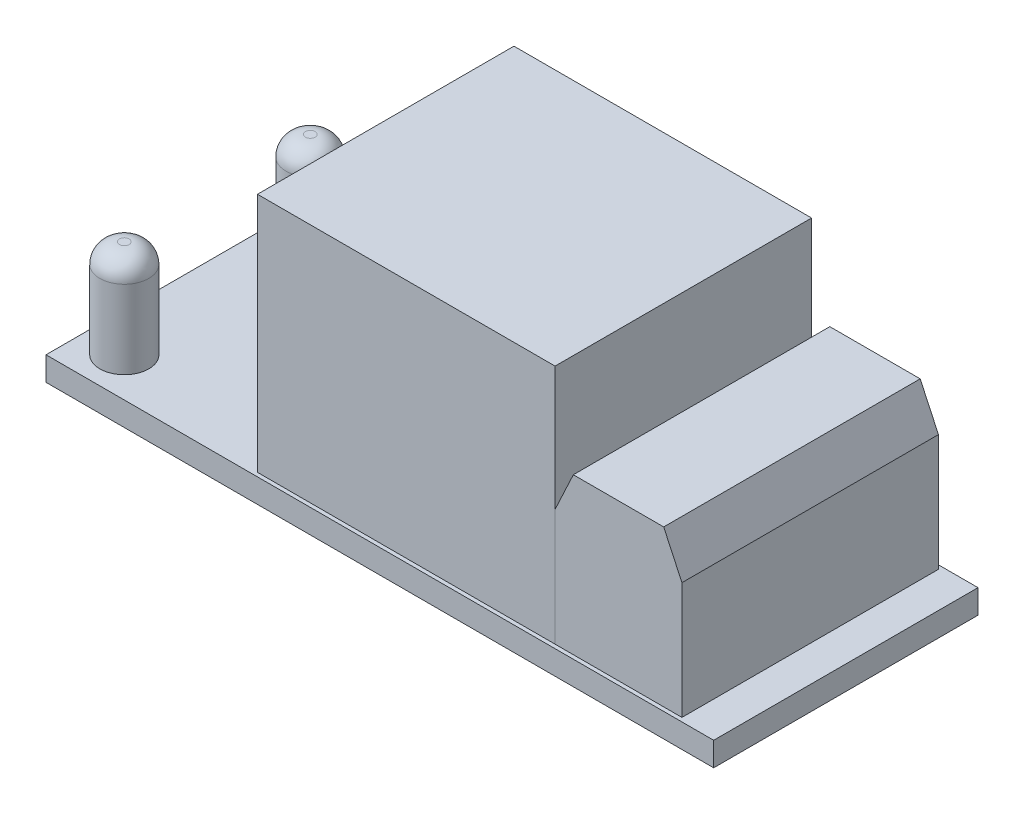
ISO-10303-21;
HEADER;
FILE_DESCRIPTION(('STEP AP214'),'2;1');
FILE_NAME('part.step','',(''),(''),'','','');
FILE_SCHEMA(('AUTOMOTIVE_DESIGN { 1 0 10303 214 1 1 1 1 }'));
ENDSEC;
DATA;
#1=APPLICATION_CONTEXT('core data for automotive mechanical design processes');
#2=APPLICATION_PROTOCOL_DEFINITION('international standard','automotive_design',2000,#1);
#3=PRODUCT_CONTEXT('',#1,'mechanical');
#4=PRODUCT('Part','Part','',(#3));
#5=PRODUCT_RELATED_PRODUCT_CATEGORY('part','',(#4));
#6=PRODUCT_DEFINITION_FORMATION('','',#4);
#7=PRODUCT_DEFINITION_CONTEXT('part definition',#1,'design');
#8=PRODUCT_DEFINITION('design','',#6,#7);
#9=PRODUCT_DEFINITION_SHAPE('','',#8);
#10=(LENGTH_UNIT() NAMED_UNIT(*) SI_UNIT(.MILLI.,.METRE.));
#11=(NAMED_UNIT(*) PLANE_ANGLE_UNIT() SI_UNIT($,.RADIAN.));
#12=(NAMED_UNIT(*) SI_UNIT($,.STERADIAN.) SOLID_ANGLE_UNIT());
#13=UNCERTAINTY_MEASURE_WITH_UNIT(LENGTH_MEASURE(1.E-05),#10,'distance_accuracy_value','');
#14=(GEOMETRIC_REPRESENTATION_CONTEXT(3) GLOBAL_UNCERTAINTY_ASSIGNED_CONTEXT((#13)) GLOBAL_UNIT_ASSIGNED_CONTEXT((#10,
#11,#12)) REPRESENTATION_CONTEXT('',''));
#15=CARTESIAN_POINT('',(0.,0.,0.));
#16=DIRECTION('',(0.,0.,1.));
#17=DIRECTION('',(1.,0.,0.));
#18=AXIS2_PLACEMENT_3D('',#15,#16,#17);
#19=CARTESIAN_POINT('',(-19.1135,7.8994,-6.0325));
#20=DIRECTION('',(0.,-1.,0.));
#21=DIRECTION('',(0.,0.,-1.));
#22=AXIS2_PLACEMENT_3D('',#19,#20,#21);
#23=CYLINDRICAL_SURFACE('',#22,1.5875);
#24=CARTESIAN_POINT('',(-19.1135,6.6294,-6.0325));
#25=DIRECTION('',(0.,1.,0.));
#26=DIRECTION('',(0.,0.,1.));
#27=AXIS2_PLACEMENT_3D('',#24,#25,#26);
#28=CIRCLE('',#27,1.5875);
#29=CARTESIAN_POINT('',(-19.1135,6.6294,-4.445));
#30=VERTEX_POINT('',#29);
#31=EDGE_CURVE('E11',#30,#30,#28,.F.);
#32=ORIENTED_EDGE('',*,*,#31,.T.);
#33=EDGE_LOOP('',(#32));
#34=FACE_BOUND('',#33,.T.);
#35=CARTESIAN_POINT('',(-19.1135,1.5494,-6.0325));
#36=DIRECTION('',(0.,1.,0.));
#37=DIRECTION('',(0.,0.,1.));
#38=AXIS2_PLACEMENT_3D('',#35,#36,#37);
#39=CIRCLE('',#38,1.5875);
#40=CARTESIAN_POINT('',(-19.1135,1.5494,-4.445));
#41=VERTEX_POINT('',#40);
#42=EDGE_CURVE('E52',#41,#41,#39,.T.);
#43=ORIENTED_EDGE('',*,*,#42,.T.);
#44=EDGE_LOOP('',(#43));
#45=FACE_BOUND('',#44,.T.);
#46=ADVANCED_FACE('F41',(#34,#45),#23,.T.);
#47=CARTESIAN_POINT('',(0.,7.8994,0.));
#48=DIRECTION('',(0.,1.,0.));
#49=DIRECTION('',(0.,0.,1.));
#50=AXIS2_PLACEMENT_3D('',#47,#48,#49);
#51=PLANE('',#50);
#52=CARTESIAN_POINT('',(-19.1135,7.8994,-6.0325));
#53=DIRECTION('',(0.,1.,0.));
#54=DIRECTION('',(0.,0.,1.));
#55=AXIS2_PLACEMENT_3D('',#52,#53,#54);
#56=CIRCLE('',#55,0.317499999999999);
#57=CARTESIAN_POINT('',(-19.1135,7.8994,-5.715));
#58=VERTEX_POINT('',#57);
#59=EDGE_CURVE('E48',#58,#58,#56,.T.);
#60=ORIENTED_EDGE('',*,*,#59,.T.);
#61=EDGE_LOOP('',(#60));
#62=FACE_BOUND('',#61,.T.);
#63=ADVANCED_FACE('F62',(#62),#51,.T.);
#64=CARTESIAN_POINT('',(0.,1.5494,0.));
#65=DIRECTION('',(0.,1.,0.));
#66=DIRECTION('',(0.,0.,1.));
#67=AXIS2_PLACEMENT_3D('',#64,#65,#66);
#68=PLANE('',#67);
#69=ORIENTED_EDGE('',*,*,#42,.F.);
#70=EDGE_LOOP('',(#69));
#71=FACE_BOUND('',#70,.T.);
#72=ADVANCED_FACE('F60',(#71),#68,.F.);
#73=CARTESIAN_POINT('',(-19.1135,6.6294,-6.0325));
#74=DIRECTION('',(0.,1.,0.));
#75=DIRECTION('',(0.,0.,1.));
#76=AXIS2_PLACEMENT_3D('',#73,#74,#75);
#77=DEGENERATE_TOROIDAL_SURFACE('',#76,0.317499999999999,1.27,.T.);
#78=ORIENTED_EDGE('',*,*,#31,.F.);
#79=EDGE_LOOP('',(#78));
#80=FACE_BOUND('',#79,.T.);
#81=ORIENTED_EDGE('',*,*,#59,.F.);
#82=EDGE_LOOP('',(#81));
#83=FACE_BOUND('',#82,.T.);
#84=ADVANCED_FACE('F43',(#80,#83),#77,.T.);
#85=CLOSED_SHELL('',(#46,#63,#72,#84));
#86=MANIFOLD_SOLID_BREP('B2',#85);
#87=CARTESIAN_POINT('',(11.1125,11.6586,8.3185));
#88=DIRECTION('',(1.,0.,0.));
#89=DIRECTION('',(0.,0.,-1.));
#90=AXIS2_PLACEMENT_3D('',#87,#88,#89);
#91=PLANE('',#90);
#92=DIRECTION('',(0.,-1.,0.));
#93=VECTOR('',#92,1.);
#94=CARTESIAN_POINT('',(11.1125,11.6586,8.3185));
#95=LINE('',#94,#93);
#96=CARTESIAN_POINT('',(11.1125,9.11859999999998,8.3185));
#97=VERTEX_POINT('',#96);
#98=CARTESIAN_POINT('',(11.1125,1.5494,8.3185));
#99=VERTEX_POINT('',#98);
#100=EDGE_CURVE('E156',#97,#99,#95,.T.);
#101=ORIENTED_EDGE('',*,*,#100,.F.);
#102=DIRECTION('',(0.,0.,-1.));
#103=VECTOR('',#102,1.);
#104=CARTESIAN_POINT('',(11.1125,9.11859999999998,8.3185));
#105=LINE('',#104,#103);
#106=CARTESIAN_POINT('',(11.1125,9.11859999999998,-8.3185));
#107=VERTEX_POINT('',#106);
#108=EDGE_CURVE('E39',#97,#107,#105,.T.);
#109=ORIENTED_EDGE('',*,*,#108,.T.);
#110=DIRECTION('',(0.,-1.,0.));
#111=VECTOR('',#110,1.);
#112=CARTESIAN_POINT('',(11.1125,11.6586,-8.3185));
#113=LINE('',#112,#111);
#114=CARTESIAN_POINT('',(11.1125,1.5494,-8.3185));
#115=VERTEX_POINT('',#114);
#116=EDGE_CURVE('E176',#107,#115,#113,.T.);
#117=ORIENTED_EDGE('',*,*,#116,.T.);
#118=DIRECTION('',(0.,0.,1.));
#119=VECTOR('',#118,1.);
#120=CARTESIAN_POINT('',(11.1125,1.5494,8.3185));
#121=LINE('',#120,#119);
#122=EDGE_CURVE('E171',#115,#99,#121,.T.);
#123=ORIENTED_EDGE('',*,*,#122,.T.);
#124=EDGE_LOOP('',(#101,#109,#117,#123));
#125=FACE_BOUND('',#124,.T.);
#126=ADVANCED_FACE('F105',(#125),#91,.F.);
#127=CARTESIAN_POINT('',(11.1125,11.6586,8.3185));
#128=DIRECTION('',(0.,0.,-1.));
#129=DIRECTION('',(-1.,0.,0.));
#130=AXIS2_PLACEMENT_3D('',#127,#128,#129);
#131=PLANE('',#130);
#132=DIRECTION('',(0.,-1.,0.));
#133=VECTOR('',#132,1.);
#134=CARTESIAN_POINT('',(19.3421,11.6586,8.3185));
#135=LINE('',#134,#133);
#136=CARTESIAN_POINT('',(19.3421,9.11859999999997,8.3185));
#137=VERTEX_POINT('',#136);
#138=CARTESIAN_POINT('',(19.3421,1.5494,8.3185));
#139=VERTEX_POINT('',#138);
#140=EDGE_CURVE('E165',#137,#139,#135,.T.);
#141=ORIENTED_EDGE('',*,*,#140,.F.);
#142=DIRECTION('',(0.422618261740696,-0.906307787036652,0.));
#143=VECTOR('',#142,1.);
#144=CARTESIAN_POINT('',(18.1576785482863,11.6586,8.3185));
#145=LINE('',#144,#143);
#146=CARTESIAN_POINT('',(18.1576785482863,11.6586,8.3185));
#147=VERTEX_POINT('',#146);
#148=EDGE_CURVE('E113',#137,#147,#145,.F.);
#149=ORIENTED_EDGE('',*,*,#148,.T.);
#150=DIRECTION('',(1.,0.,0.));
#151=VECTOR('',#150,1.);
#152=CARTESIAN_POINT('',(11.1125,11.6586,8.3185));
#153=LINE('',#152,#151);
#154=CARTESIAN_POINT('',(12.2969214517137,11.6586,8.3185));
#155=VERTEX_POINT('',#154);
#156=EDGE_CURVE('E186',#155,#147,#153,.T.);
#157=ORIENTED_EDGE('',*,*,#156,.F.);
#158=DIRECTION('',(0.422618261740697,0.906307787036651,0.));
#159=VECTOR('',#158,1.);
#160=CARTESIAN_POINT('',(12.2969214517137,11.6586,8.3185));
#161=LINE('',#160,#159);
#162=EDGE_CURVE('E120',#155,#97,#161,.F.);
#163=ORIENTED_EDGE('',*,*,#162,.T.);
#164=ORIENTED_EDGE('',*,*,#100,.T.);
#165=DIRECTION('',(1.,0.,0.));
#166=VECTOR('',#165,1.);
#167=CARTESIAN_POINT('',(11.1125,1.5494,8.3185));
#168=LINE('',#167,#166);
#169=EDGE_CURVE('E159',#99,#139,#168,.T.);
#170=ORIENTED_EDGE('',*,*,#169,.T.);
#171=EDGE_LOOP('',(#141,#149,#157,#163,#164,#170));
#172=FACE_BOUND('',#171,.T.);
#173=ADVANCED_FACE('F158',(#172),#131,.F.);
#174=CARTESIAN_POINT('',(19.3421,11.6586,8.3185));
#175=DIRECTION('',(-1.,0.,0.));
#176=DIRECTION('',(0.,0.,1.));
#177=AXIS2_PLACEMENT_3D('',#174,#175,#176);
#178=PLANE('',#177);
#179=DIRECTION('',(0.,-1.,0.));
#180=VECTOR('',#179,1.);
#181=CARTESIAN_POINT('',(19.3421,11.6586,-8.3185));
#182=LINE('',#181,#180);
#183=CARTESIAN_POINT('',(19.3421,9.11859999999997,-8.3185));
#184=VERTEX_POINT('',#183);
#185=CARTESIAN_POINT('',(19.3421,1.5494,-8.3185));
#186=VERTEX_POINT('',#185);
#187=EDGE_CURVE('E188',#184,#186,#182,.T.);
#188=ORIENTED_EDGE('',*,*,#187,.F.);
#189=DIRECTION('',(0.,0.,1.));
#190=VECTOR('',#189,1.);
#191=CARTESIAN_POINT('',(19.3421,9.11859999999997,8.3185));
#192=LINE('',#191,#190);
#193=EDGE_CURVE('E128',#184,#137,#192,.T.);
#194=ORIENTED_EDGE('',*,*,#193,.T.);
#195=ORIENTED_EDGE('',*,*,#140,.T.);
#196=DIRECTION('',(0.,0.,-1.));
#197=VECTOR('',#196,1.);
#198=CARTESIAN_POINT('',(19.3421,1.5494,8.3185));
#199=LINE('',#198,#197);
#200=EDGE_CURVE('E173',#139,#186,#199,.T.);
#201=ORIENTED_EDGE('',*,*,#200,.T.);
#202=EDGE_LOOP('',(#188,#194,#195,#201));
#203=FACE_BOUND('',#202,.T.);
#204=ADVANCED_FACE('F213',(#203),#178,.F.);
#205=CARTESIAN_POINT('',(11.1125,11.6586,-8.3185));
#206=DIRECTION('',(0.,0.,1.));
#207=DIRECTION('',(1.,0.,0.));
#208=AXIS2_PLACEMENT_3D('',#205,#206,#207);
#209=PLANE('',#208);
#210=DIRECTION('',(-1.,0.,0.));
#211=VECTOR('',#210,1.);
#212=CARTESIAN_POINT('',(11.1125,11.6586,-8.3185));
#213=LINE('',#212,#211);
#214=CARTESIAN_POINT('',(18.1576785482863,11.6586,-8.3185));
#215=VERTEX_POINT('',#214);
#216=CARTESIAN_POINT('',(12.2969214517137,11.6586,-8.3185));
#217=VERTEX_POINT('',#216);
#218=EDGE_CURVE('E180',#215,#217,#213,.T.);
#219=ORIENTED_EDGE('',*,*,#218,.F.);
#220=DIRECTION('',(-0.422618261740696,0.906307787036652,0.));
#221=VECTOR('',#220,1.);
#222=CARTESIAN_POINT('',(18.1576785482863,11.6586,-8.3185));
#223=LINE('',#222,#221);
#224=EDGE_CURVE('E198',#215,#184,#223,.F.);
#225=ORIENTED_EDGE('',*,*,#224,.T.);
#226=ORIENTED_EDGE('',*,*,#187,.T.);
#227=DIRECTION('',(-1.,0.,0.));
#228=VECTOR('',#227,1.);
#229=CARTESIAN_POINT('',(11.1125,1.5494,-8.3185));
#230=LINE('',#229,#228);
#231=EDGE_CURVE('E184',#186,#115,#230,.T.);
#232=ORIENTED_EDGE('',*,*,#231,.T.);
#233=ORIENTED_EDGE('',*,*,#116,.F.);
#234=DIRECTION('',(-0.422618261740697,-0.906307787036651,0.));
#235=VECTOR('',#234,1.);
#236=CARTESIAN_POINT('',(12.2969214517137,11.6586,-8.3185));
#237=LINE('',#236,#235);
#238=EDGE_CURVE('E196',#107,#217,#237,.F.);
#239=ORIENTED_EDGE('',*,*,#238,.T.);
#240=EDGE_LOOP('',(#219,#225,#226,#232,#233,#239));
#241=FACE_BOUND('',#240,.T.);
#242=ADVANCED_FACE('F212',(#241),#209,.F.);
#243=CARTESIAN_POINT('',(0.,11.6586,0.));
#244=DIRECTION('',(0.,-1.,0.));
#245=DIRECTION('',(0.,0.,-1.));
#246=AXIS2_PLACEMENT_3D('',#243,#244,#245);
#247=PLANE('',#246);
#248=ORIENTED_EDGE('',*,*,#156,.T.);
#249=DIRECTION('',(0.,0.,-1.));
#250=VECTOR('',#249,1.);
#251=CARTESIAN_POINT('',(18.1576785482863,11.6586,0.));
#252=LINE('',#251,#250);
#253=EDGE_CURVE('E193',#147,#215,#252,.T.);
#254=ORIENTED_EDGE('',*,*,#253,.T.);
#255=ORIENTED_EDGE('',*,*,#218,.T.);
#256=DIRECTION('',(0.,0.,1.));
#257=VECTOR('',#256,1.);
#258=CARTESIAN_POINT('',(12.2969214517137,11.6586,0.));
#259=LINE('',#258,#257);
#260=EDGE_CURVE('E164',#217,#155,#259,.T.);
#261=ORIENTED_EDGE('',*,*,#260,.T.);
#262=EDGE_LOOP('',(#248,#254,#255,#261));
#263=FACE_BOUND('',#262,.T.);
#264=ADVANCED_FACE('F206',(#263),#247,.F.);
#265=CARTESIAN_POINT('',(0.,1.5494,0.));
#266=DIRECTION('',(0.,-1.,0.));
#267=DIRECTION('',(0.,0.,-1.));
#268=AXIS2_PLACEMENT_3D('',#265,#266,#267);
#269=PLANE('',#268);
#270=ORIENTED_EDGE('',*,*,#122,.F.);
#271=ORIENTED_EDGE('',*,*,#231,.F.);
#272=ORIENTED_EDGE('',*,*,#200,.F.);
#273=ORIENTED_EDGE('',*,*,#169,.F.);
#274=EDGE_LOOP('',(#270,#271,#272,#273));
#275=FACE_BOUND('',#274,.T.);
#276=ADVANCED_FACE('F169',(#275),#269,.T.);
#277=CARTESIAN_POINT('',(18.1576785482863,11.6586,0.));
#278=DIRECTION('',(-0.906307787036651,-0.422618261740696,0.));
#279=DIRECTION('',(0.,0.,-1.));
#280=AXIS2_PLACEMENT_3D('',#277,#278,#279);
#281=PLANE('',#280);
#282=ORIENTED_EDGE('',*,*,#148,.F.);
#283=ORIENTED_EDGE('',*,*,#193,.F.);
#284=ORIENTED_EDGE('',*,*,#224,.F.);
#285=ORIENTED_EDGE('',*,*,#253,.F.);
#286=EDGE_LOOP('',(#282,#283,#284,#285));
#287=FACE_BOUND('',#286,.T.);
#288=ADVANCED_FACE('F210',(#287),#281,.F.);
#289=CARTESIAN_POINT('',(12.2969214517137,11.6586,0.));
#290=DIRECTION('',(0.906307787036651,-0.422618261740697,0.));
#291=DIRECTION('',(0.,0.,1.));
#292=AXIS2_PLACEMENT_3D('',#289,#290,#291);
#293=PLANE('',#292);
#294=ORIENTED_EDGE('',*,*,#238,.F.);
#295=ORIENTED_EDGE('',*,*,#108,.F.);
#296=ORIENTED_EDGE('',*,*,#162,.F.);
#297=ORIENTED_EDGE('',*,*,#260,.F.);
#298=EDGE_LOOP('',(#294,#295,#296,#297));
#299=FACE_BOUND('',#298,.T.);
#300=ADVANCED_FACE('F107',(#299),#293,.F.);
#301=CLOSED_SHELL('',(#126,#173,#204,#242,#264,#276,#288,#300));
#302=MANIFOLD_SOLID_BREP('B6',#301);
#303=CARTESIAN_POINT('',(0.,1.5494,0.));
#304=DIRECTION('',(0.,1.,0.));
#305=DIRECTION('',(0.,0.,1.));
#306=AXIS2_PLACEMENT_3D('',#303,#304,#305);
#307=PLANE('',#306);
#308=DIRECTION('',(1.,0.,0.));
#309=VECTOR('',#308,1.);
#310=CARTESIAN_POINT('',(-8.1915,1.5494,8.3185));
#311=LINE('',#310,#309);
#312=CARTESIAN_POINT('',(-8.1915,1.5494,8.3185));
#313=VERTEX_POINT('',#312);
#314=CARTESIAN_POINT('',(11.1125,1.5494,8.3185));
#315=VERTEX_POINT('',#314);
#316=EDGE_CURVE('E457',#313,#315,#311,.T.);
#317=ORIENTED_EDGE('',*,*,#316,.F.);
#318=DIRECTION('',(0.,0.,1.));
#319=VECTOR('',#318,1.);
#320=CARTESIAN_POINT('',(-8.1915,1.5494,-8.3185));
#321=LINE('',#320,#319);
#322=CARTESIAN_POINT('',(-8.1915,1.5494,-8.3185));
#323=VERTEX_POINT('',#322);
#324=EDGE_CURVE('E378',#323,#313,#321,.T.);
#325=ORIENTED_EDGE('',*,*,#324,.F.);
#326=DIRECTION('',(-1.,0.,0.));
#327=VECTOR('',#326,1.);
#328=CARTESIAN_POINT('',(-8.1915,1.5494,-8.3185));
#329=LINE('',#328,#327);
#330=CARTESIAN_POINT('',(11.1125,1.5494,-8.3185));
#331=VERTEX_POINT('',#330);
#332=EDGE_CURVE('E374',#331,#323,#329,.T.);
#333=ORIENTED_EDGE('',*,*,#332,.F.);
#334=DIRECTION('',(0.,0.,-1.));
#335=VECTOR('',#334,1.);
#336=CARTESIAN_POINT('',(11.1125,1.5494,-8.3185));
#337=LINE('',#336,#335);
#338=EDGE_CURVE('E464',#315,#331,#337,.T.);
#339=ORIENTED_EDGE('',*,*,#338,.F.);
#340=EDGE_LOOP('',(#317,#325,#333,#339));
#341=FACE_BOUND('',#340,.T.);
#342=DIRECTION('',(0.,0.,1.));
#343=VECTOR('',#342,1.);
#344=CARTESIAN_POINT('',(-21.6535,1.5494,8.5725));
#345=LINE('',#344,#343);
#346=CARTESIAN_POINT('',(-21.6535,1.5494,-8.5725));
#347=VERTEX_POINT('',#346);
#348=CARTESIAN_POINT('',(-21.6535,1.5494,8.5725));
#349=VERTEX_POINT('',#348);
#350=EDGE_CURVE('E388',#347,#349,#345,.T.);
#351=ORIENTED_EDGE('',*,*,#350,.T.);
#352=DIRECTION('',(1.,0.,0.));
#353=VECTOR('',#352,1.);
#354=CARTESIAN_POINT('',(21.6535,1.5494,8.5725));
#355=LINE('',#354,#353);
#356=CARTESIAN_POINT('',(21.6535,1.5494,8.5725));
#357=VERTEX_POINT('',#356);
#358=EDGE_CURVE('E333',#349,#357,#355,.T.);
#359=ORIENTED_EDGE('',*,*,#358,.T.);
#360=DIRECTION('',(0.,0.,-1.));
#361=VECTOR('',#360,1.);
#362=CARTESIAN_POINT('',(21.6535,1.5494,8.5725));
#363=LINE('',#362,#361);
#364=CARTESIAN_POINT('',(21.6535,1.5494,-8.5725));
#365=VERTEX_POINT('',#364);
#366=EDGE_CURVE('E391',#357,#365,#363,.T.);
#367=ORIENTED_EDGE('',*,*,#366,.T.);
#368=DIRECTION('',(-1.,0.,0.));
#369=VECTOR('',#368,1.);
#370=CARTESIAN_POINT('',(21.6535,1.5494,-8.5725));
#371=LINE('',#370,#369);
#372=EDGE_CURVE('E304',#365,#347,#371,.T.);
#373=ORIENTED_EDGE('',*,*,#372,.T.);
#374=EDGE_LOOP('',(#351,#359,#367,#373));
#375=FACE_BOUND('',#374,.T.);
#376=CARTESIAN_POINT('',(-19.1135,1.5494,6.0325));
#377=DIRECTION('',(0.,1.,0.));
#378=DIRECTION('',(0.,0.,1.));
#379=AXIS2_PLACEMENT_3D('',#376,#377,#378);
#380=CIRCLE('',#379,1.5875);
#381=CARTESIAN_POINT('',(-19.1135,1.5494,7.62));
#382=VERTEX_POINT('',#381);
#383=EDGE_CURVE('E454',#382,#382,#380,.T.);
#384=ORIENTED_EDGE('',*,*,#383,.F.);
#385=EDGE_LOOP('',(#384));
#386=FACE_BOUND('',#385,.T.);
#387=ADVANCED_FACE('F280',(#341,#375,#386),#307,.T.);
#388=CARTESIAN_POINT('',(-21.6535,1.5494,8.5725));
#389=DIRECTION('',(1.,0.,0.));
#390=DIRECTION('',(0.,0.,-1.));
#391=AXIS2_PLACEMENT_3D('',#388,#389,#390);
#392=PLANE('',#391);
#393=DIRECTION('',(0.,0.,1.));
#394=VECTOR('',#393,1.);
#395=CARTESIAN_POINT('',(-21.6535,0.,8.5725));
#396=LINE('',#395,#394);
#397=CARTESIAN_POINT('',(-21.6535,0.,-8.5725));
#398=VERTEX_POINT('',#397);
#399=CARTESIAN_POINT('',(-21.6535,0.,8.5725));
#400=VERTEX_POINT('',#399);
#401=EDGE_CURVE('E380',#398,#400,#396,.T.);
#402=ORIENTED_EDGE('',*,*,#401,.T.);
#403=DIRECTION('',(0.,-1.,0.));
#404=VECTOR('',#403,1.);
#405=CARTESIAN_POINT('',(-21.6535,1.5494,8.5725));
#406=LINE('',#405,#404);
#407=EDGE_CURVE('E405',#349,#400,#406,.T.);
#408=ORIENTED_EDGE('',*,*,#407,.F.);
#409=ORIENTED_EDGE('',*,*,#350,.F.);
#410=DIRECTION('',(0.,-1.,0.));
#411=VECTOR('',#410,1.);
#412=CARTESIAN_POINT('',(-21.6535,1.5494,-8.5725));
#413=LINE('',#412,#411);
#414=EDGE_CURVE('E393',#347,#398,#413,.T.);
#415=ORIENTED_EDGE('',*,*,#414,.T.);
#416=EDGE_LOOP('',(#402,#408,#409,#415));
#417=FACE_BOUND('',#416,.T.);
#418=ADVANCED_FACE('F420',(#417),#392,.F.);
#419=CARTESIAN_POINT('',(21.6535,1.5494,8.5725));
#420=DIRECTION('',(0.,0.,-1.));
#421=DIRECTION('',(-1.,0.,0.));
#422=AXIS2_PLACEMENT_3D('',#419,#420,#421);
#423=PLANE('',#422);
#424=DIRECTION('',(1.,0.,0.));
#425=VECTOR('',#424,1.);
#426=CARTESIAN_POINT('',(21.6535,0.,8.5725));
#427=LINE('',#426,#425);
#428=CARTESIAN_POINT('',(21.6535,0.,8.5725));
#429=VERTEX_POINT('',#428);
#430=EDGE_CURVE('E383',#400,#429,#427,.T.);
#431=ORIENTED_EDGE('',*,*,#430,.T.);
#432=DIRECTION('',(0.,-1.,0.));
#433=VECTOR('',#432,1.);
#434=CARTESIAN_POINT('',(21.6535,1.5494,8.5725));
#435=LINE('',#434,#433);
#436=EDGE_CURVE('E402',#357,#429,#435,.T.);
#437=ORIENTED_EDGE('',*,*,#436,.F.);
#438=ORIENTED_EDGE('',*,*,#358,.F.);
#439=ORIENTED_EDGE('',*,*,#407,.T.);
#440=EDGE_LOOP('',(#431,#437,#438,#439));
#441=FACE_BOUND('',#440,.T.);
#442=ADVANCED_FACE('F426',(#441),#423,.F.);
#443=CARTESIAN_POINT('',(21.6535,1.5494,8.5725));
#444=DIRECTION('',(-1.,0.,0.));
#445=DIRECTION('',(0.,0.,1.));
#446=AXIS2_PLACEMENT_3D('',#443,#444,#445);
#447=PLANE('',#446);
#448=DIRECTION('',(0.,0.,-1.));
#449=VECTOR('',#448,1.);
#450=CARTESIAN_POINT('',(21.6535,0.,8.5725));
#451=LINE('',#450,#449);
#452=CARTESIAN_POINT('',(21.6535,0.,-8.5725));
#453=VERTEX_POINT('',#452);
#454=EDGE_CURVE('E396',#429,#453,#451,.T.);
#455=ORIENTED_EDGE('',*,*,#454,.T.);
#456=DIRECTION('',(0.,-1.,0.));
#457=VECTOR('',#456,1.);
#458=CARTESIAN_POINT('',(21.6535,1.5494,-8.5725));
#459=LINE('',#458,#457);
#460=EDGE_CURVE('E400',#365,#453,#459,.T.);
#461=ORIENTED_EDGE('',*,*,#460,.F.);
#462=ORIENTED_EDGE('',*,*,#366,.F.);
#463=ORIENTED_EDGE('',*,*,#436,.T.);
#464=EDGE_LOOP('',(#455,#461,#462,#463));
#465=FACE_BOUND('',#464,.T.);
#466=ADVANCED_FACE('F438',(#465),#447,.F.);
#467=CARTESIAN_POINT('',(21.6535,1.5494,-8.5725));
#468=DIRECTION('',(0.,0.,1.));
#469=DIRECTION('',(1.,0.,0.));
#470=AXIS2_PLACEMENT_3D('',#467,#468,#469);
#471=PLANE('',#470);
#472=DIRECTION('',(-1.,0.,0.));
#473=VECTOR('',#472,1.);
#474=CARTESIAN_POINT('',(21.6535,0.,-8.5725));
#475=LINE('',#474,#473);
#476=EDGE_CURVE('E325',#453,#398,#475,.T.);
#477=ORIENTED_EDGE('',*,*,#476,.T.);
#478=ORIENTED_EDGE('',*,*,#414,.F.);
#479=ORIENTED_EDGE('',*,*,#372,.F.);
#480=ORIENTED_EDGE('',*,*,#460,.T.);
#481=EDGE_LOOP('',(#477,#478,#479,#480));
#482=FACE_BOUND('',#481,.T.);
#483=ADVANCED_FACE('F434',(#482),#471,.F.);
#484=CARTESIAN_POINT('',(0.,0.,0.));
#485=DIRECTION('',(0.,1.,0.));
#486=DIRECTION('',(0.,0.,1.));
#487=AXIS2_PLACEMENT_3D('',#484,#485,#486);
#488=PLANE('',#487);
#489=ORIENTED_EDGE('',*,*,#401,.F.);
#490=ORIENTED_EDGE('',*,*,#476,.F.);
#491=ORIENTED_EDGE('',*,*,#454,.F.);
#492=ORIENTED_EDGE('',*,*,#430,.F.);
#493=EDGE_LOOP('',(#489,#490,#491,#492));
#494=FACE_BOUND('',#493,.T.);
#495=ADVANCED_FACE('F431',(#494),#488,.F.);
#496=CARTESIAN_POINT('',(-8.1915,17.1704,-8.3185));
#497=DIRECTION('',(1.,0.,0.));
#498=DIRECTION('',(0.,0.,-1.));
#499=AXIS2_PLACEMENT_3D('',#496,#497,#498);
#500=PLANE('',#499);
#501=ORIENTED_EDGE('',*,*,#324,.T.);
#502=DIRECTION('',(0.,-1.,0.));
#503=VECTOR('',#502,1.);
#504=CARTESIAN_POINT('',(-8.1915,17.1704,8.3185));
#505=LINE('',#504,#503);
#506=CARTESIAN_POINT('',(-8.1915,17.1704,8.3185));
#507=VERTEX_POINT('',#506);
#508=EDGE_CURVE('E359',#507,#313,#505,.T.);
#509=ORIENTED_EDGE('',*,*,#508,.F.);
#510=DIRECTION('',(0.,0.,1.));
#511=VECTOR('',#510,1.);
#512=CARTESIAN_POINT('',(-8.1915,17.1704,-8.3185));
#513=LINE('',#512,#511);
#514=CARTESIAN_POINT('',(-8.1915,17.1704,-8.3185));
#515=VERTEX_POINT('',#514);
#516=EDGE_CURVE('E366',#515,#507,#513,.T.);
#517=ORIENTED_EDGE('',*,*,#516,.F.);
#518=DIRECTION('',(0.,-1.,0.));
#519=VECTOR('',#518,1.);
#520=CARTESIAN_POINT('',(-8.1915,17.1704,-8.3185));
#521=LINE('',#520,#519);
#522=EDGE_CURVE('E461',#515,#323,#521,.T.);
#523=ORIENTED_EDGE('',*,*,#522,.T.);
#524=EDGE_LOOP('',(#501,#509,#517,#523));
#525=FACE_BOUND('',#524,.T.);
#526=ADVANCED_FACE('F376',(#525),#500,.F.);
#527=CARTESIAN_POINT('',(-8.1915,17.1704,8.3185));
#528=DIRECTION('',(0.,0.,-1.));
#529=DIRECTION('',(-1.,0.,0.));
#530=AXIS2_PLACEMENT_3D('',#527,#528,#529);
#531=PLANE('',#530);
#532=ORIENTED_EDGE('',*,*,#316,.T.);
#533=DIRECTION('',(0.,-1.,0.));
#534=VECTOR('',#533,1.);
#535=CARTESIAN_POINT('',(11.1125,17.1704,8.3185));
#536=LINE('',#535,#534);
#537=CARTESIAN_POINT('',(11.1125,17.1704,8.3185));
#538=VERTEX_POINT('',#537);
#539=EDGE_CURVE('E362',#538,#315,#536,.T.);
#540=ORIENTED_EDGE('',*,*,#539,.F.);
#541=DIRECTION('',(1.,0.,0.));
#542=VECTOR('',#541,1.);
#543=CARTESIAN_POINT('',(-8.1915,17.1704,8.3185));
#544=LINE('',#543,#542);
#545=EDGE_CURVE('E355',#507,#538,#544,.T.);
#546=ORIENTED_EDGE('',*,*,#545,.F.);
#547=ORIENTED_EDGE('',*,*,#508,.T.);
#548=EDGE_LOOP('',(#532,#540,#546,#547));
#549=FACE_BOUND('',#548,.T.);
#550=ADVANCED_FACE('F357',(#549),#531,.F.);
#551=CARTESIAN_POINT('',(11.1125,17.1704,-8.3185));
#552=DIRECTION('',(-1.,0.,0.));
#553=DIRECTION('',(0.,0.,1.));
#554=AXIS2_PLACEMENT_3D('',#551,#552,#553);
#555=PLANE('',#554);
#556=ORIENTED_EDGE('',*,*,#338,.T.);
#557=DIRECTION('',(0.,-1.,0.));
#558=VECTOR('',#557,1.);
#559=CARTESIAN_POINT('',(11.1125,17.1704,-8.3185));
#560=LINE('',#559,#558);
#561=CARTESIAN_POINT('',(11.1125,17.1704,-8.3185));
#562=VERTEX_POINT('',#561);
#563=EDGE_CURVE('E295',#562,#331,#560,.T.);
#564=ORIENTED_EDGE('',*,*,#563,.F.);
#565=DIRECTION('',(0.,0.,-1.));
#566=VECTOR('',#565,1.);
#567=CARTESIAN_POINT('',(11.1125,17.1704,-8.3185));
#568=LINE('',#567,#566);
#569=EDGE_CURVE('E365',#538,#562,#568,.T.);
#570=ORIENTED_EDGE('',*,*,#569,.F.);
#571=ORIENTED_EDGE('',*,*,#539,.T.);
#572=EDGE_LOOP('',(#556,#564,#570,#571));
#573=FACE_BOUND('',#572,.T.);
#574=ADVANCED_FACE('F470',(#573),#555,.F.);
#575=CARTESIAN_POINT('',(-8.1915,17.1704,-8.3185));
#576=DIRECTION('',(0.,0.,1.));
#577=DIRECTION('',(1.,0.,0.));
#578=AXIS2_PLACEMENT_3D('',#575,#576,#577);
#579=PLANE('',#578);
#580=ORIENTED_EDGE('',*,*,#332,.T.);
#581=ORIENTED_EDGE('',*,*,#522,.F.);
#582=DIRECTION('',(-1.,0.,0.));
#583=VECTOR('',#582,1.);
#584=CARTESIAN_POINT('',(-8.1915,17.1704,-8.3185));
#585=LINE('',#584,#583);
#586=EDGE_CURVE('E370',#562,#515,#585,.T.);
#587=ORIENTED_EDGE('',*,*,#586,.F.);
#588=ORIENTED_EDGE('',*,*,#563,.T.);
#589=EDGE_LOOP('',(#580,#581,#587,#588));
#590=FACE_BOUND('',#589,.T.);
#591=ADVANCED_FACE('F471',(#590),#579,.F.);
#592=CARTESIAN_POINT('',(0.,17.1704,0.));
#593=DIRECTION('',(0.,1.,0.));
#594=DIRECTION('',(0.,0.,1.));
#595=AXIS2_PLACEMENT_3D('',#592,#593,#594);
#596=PLANE('',#595);
#597=ORIENTED_EDGE('',*,*,#516,.T.);
#598=ORIENTED_EDGE('',*,*,#545,.T.);
#599=ORIENTED_EDGE('',*,*,#569,.T.);
#600=ORIENTED_EDGE('',*,*,#586,.T.);
#601=EDGE_LOOP('',(#597,#598,#599,#600));
#602=FACE_BOUND('',#601,.T.);
#603=ADVANCED_FACE('F369',(#602),#596,.T.);
#604=CARTESIAN_POINT('',(-19.1135,7.8994,6.0325));
#605=DIRECTION('',(0.,-1.,0.));
#606=DIRECTION('',(0.,0.,-1.));
#607=AXIS2_PLACEMENT_3D('',#604,#605,#606);
#608=CYLINDRICAL_SURFACE('',#607,1.5875);
#609=CARTESIAN_POINT('',(-19.1135,6.6294,6.0325));
#610=DIRECTION('',(0.,1.,0.));
#611=DIRECTION('',(0.,0.,1.));
#612=AXIS2_PLACEMENT_3D('',#609,#610,#611);
#613=CIRCLE('',#612,1.5875);
#614=CARTESIAN_POINT('',(-19.1135,6.6294,7.62));
#615=VERTEX_POINT('',#614);
#616=EDGE_CURVE('E103',#615,#615,#613,.F.);
#617=ORIENTED_EDGE('',*,*,#616,.T.);
#618=EDGE_LOOP('',(#617));
#619=FACE_BOUND('',#618,.T.);
#620=ORIENTED_EDGE('',*,*,#383,.T.);
#621=EDGE_LOOP('',(#620));
#622=FACE_BOUND('',#621,.T.);
#623=ADVANCED_FACE('F416',(#619,#622),#608,.T.);
#624=CARTESIAN_POINT('',(-19.1135,7.8994,6.0325));
#625=DIRECTION('',(0.,1.,0.));
#626=DIRECTION('',(0.,0.,1.));
#627=AXIS2_PLACEMENT_3D('',#624,#625,#626);
#628=PLANE('',#627);
#629=CARTESIAN_POINT('',(-19.1135,7.8994,6.0325));
#630=DIRECTION('',(0.,1.,0.));
#631=DIRECTION('',(0.,0.,1.));
#632=AXIS2_PLACEMENT_3D('',#629,#630,#631);
#633=CIRCLE('',#632,0.317499999999999);
#634=CARTESIAN_POINT('',(-19.1135,7.8994,6.35));
#635=VERTEX_POINT('',#634);
#636=EDGE_CURVE('E288',#635,#635,#633,.T.);
#637=ORIENTED_EDGE('',*,*,#636,.T.);
#638=EDGE_LOOP('',(#637));
#639=FACE_BOUND('',#638,.T.);
#640=ADVANCED_FACE('F409',(#639),#628,.T.);
#641=CARTESIAN_POINT('',(-19.1135,6.6294,6.0325));
#642=DIRECTION('',(0.,1.,0.));
#643=DIRECTION('',(0.,0.,1.));
#644=AXIS2_PLACEMENT_3D('',#641,#642,#643);
#645=DEGENERATE_TOROIDAL_SURFACE('',#644,0.317499999999999,1.27,.T.);
#646=ORIENTED_EDGE('',*,*,#616,.F.);
#647=EDGE_LOOP('',(#646));
#648=FACE_BOUND('',#647,.T.);
#649=ORIENTED_EDGE('',*,*,#636,.F.);
#650=EDGE_LOOP('',(#649));
#651=FACE_BOUND('',#650,.T.);
#652=ADVANCED_FACE('F282',(#648,#651),#645,.T.);
#653=CLOSED_SHELL('',(#387,#418,#442,#466,#483,#495,#526,#550,#574,#591,#603,#623,#640,#652));
#654=MANIFOLD_SOLID_BREP('B33',#653);
#655=ADVANCED_BREP_SHAPE_REPRESENTATION('',(#18,#86,#302,#654),#14);
#656=SHAPE_DEFINITION_REPRESENTATION(#9,#655);
ENDSEC;
END-ISO-10303-21;
